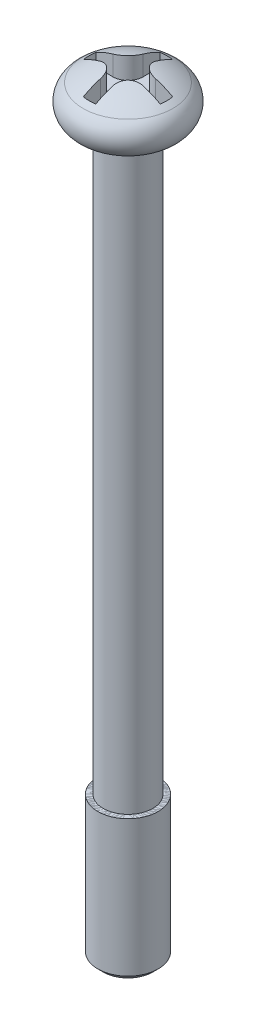
ISO-10303-21;
HEADER;
FILE_DESCRIPTION(('STEP AP214'),'2;1');
FILE_NAME('part.step','',(''),(''),'','','');
FILE_SCHEMA(('AUTOMOTIVE_DESIGN { 1 0 10303 214 1 1 1 1 }'));
ENDSEC;
DATA;
#1=APPLICATION_CONTEXT('core data for automotive mechanical design processes');
#2=APPLICATION_PROTOCOL_DEFINITION('international standard','automotive_design',2000,#1);
#3=PRODUCT_CONTEXT('',#1,'mechanical');
#4=PRODUCT('Part','Part','',(#3));
#5=PRODUCT_RELATED_PRODUCT_CATEGORY('part','',(#4));
#6=PRODUCT_DEFINITION_FORMATION('','',#4);
#7=PRODUCT_DEFINITION_CONTEXT('part definition',#1,'design');
#8=PRODUCT_DEFINITION('design','',#6,#7);
#9=PRODUCT_DEFINITION_SHAPE('','',#8);
#10=(LENGTH_UNIT() NAMED_UNIT(*) SI_UNIT(.MILLI.,.METRE.));
#11=(NAMED_UNIT(*) PLANE_ANGLE_UNIT() SI_UNIT($,.RADIAN.));
#12=(NAMED_UNIT(*) SI_UNIT($,.STERADIAN.) SOLID_ANGLE_UNIT());
#13=UNCERTAINTY_MEASURE_WITH_UNIT(LENGTH_MEASURE(1.E-05),#10,'distance_accuracy_value','');
#14=(GEOMETRIC_REPRESENTATION_CONTEXT(3) GLOBAL_UNCERTAINTY_ASSIGNED_CONTEXT((#13)) GLOBAL_UNIT_ASSIGNED_CONTEXT((#10,
#11,#12)) REPRESENTATION_CONTEXT('',''));
#15=CARTESIAN_POINT('',(0.,0.,0.));
#16=DIRECTION('',(0.,0.,1.));
#17=DIRECTION('',(1.,0.,0.));
#18=AXIS2_PLACEMENT_3D('',#15,#16,#17);
#19=CARTESIAN_POINT('',(0.,0.65,0.));
#20=DIRECTION('',(0.,-1.,0.));
#21=DIRECTION('',(0.,0.,-1.));
#22=AXIS2_PLACEMENT_3D('',#19,#20,#21);
#23=PLANE('',#22);
#24=DIRECTION('',(0.,0.,1.));
#25=VECTOR('',#24,1.);
#26=CARTESIAN_POINT('',(-0.1760407640086,0.65,1.085822107625));
#27=LINE('',#26,#25);
#28=CARTESIAN_POINT('',(-0.1760407640086,0.65,0.6010407640086));
#29=VERTEX_POINT('',#28);
#30=CARTESIAN_POINT('',(-0.1760407640086,0.65,1.08582210762502));
#31=VERTEX_POINT('',#30);
#32=EDGE_CURVE('P0_E159',#29,#31,#27,.T.);
#33=ORIENTED_EDGE('',*,*,#32,.T.);
#34=CARTESIAN_POINT('',(0.,0.65,0.));
#35=DIRECTION('',(0.,-1.,0.));
#36=DIRECTION('',(0.,0.,-1.));
#37=AXIS2_PLACEMENT_3D('',#34,#35,#36);
#38=CIRCLE('',#37,1.1);
#39=CARTESIAN_POINT('',(0.176040764008603,0.65,1.08582210762503));
#40=VERTEX_POINT('',#39);
#41=EDGE_CURVE('P0_E238',#31,#40,#38,.F.);
#42=ORIENTED_EDGE('',*,*,#41,.T.);
#43=DIRECTION('',(0.,0.,-1.));
#44=VECTOR('',#43,1.);
#45=CARTESIAN_POINT('',(0.1760407640086,0.65,0.6010407640086));
#46=LINE('',#45,#44);
#47=CARTESIAN_POINT('',(0.1760407640086,0.65,0.6010407640086));
#48=VERTEX_POINT('',#47);
#49=EDGE_CURVE('P0_E163',#40,#48,#46,.T.);
#50=ORIENTED_EDGE('',*,*,#49,.T.);
#51=CARTESIAN_POINT('',(0.6010407640086,0.65,0.6010407640086));
#52=DIRECTION('',(0.,-1.,0.));
#53=DIRECTION('',(0.,0.,-1.));
#54=AXIS2_PLACEMENT_3D('',#51,#52,#53);
#55=CIRCLE('',#54,0.425);
#56=CARTESIAN_POINT('',(0.6010407640086,0.65,0.1760407640086));
#57=VERTEX_POINT('',#56);
#58=EDGE_CURVE('P0_E166',#57,#48,#55,.F.);
#59=ORIENTED_EDGE('',*,*,#58,.F.);
#60=DIRECTION('',(1.,0.,0.));
#61=VECTOR('',#60,1.);
#62=CARTESIAN_POINT('',(1.085822107625,0.65,0.1760407640086));
#63=LINE('',#62,#61);
#64=CARTESIAN_POINT('',(1.08582210762502,0.65,0.1760407640086));
#65=VERTEX_POINT('',#64);
#66=EDGE_CURVE('P0_E167',#57,#65,#63,.T.);
#67=ORIENTED_EDGE('',*,*,#66,.T.);
#68=CARTESIAN_POINT('',(0.,0.65,0.));
#69=DIRECTION('',(0.,-1.,0.));
#70=DIRECTION('',(0.,0.,-1.));
#71=AXIS2_PLACEMENT_3D('',#68,#69,#70);
#72=CIRCLE('',#71,1.1);
#73=CARTESIAN_POINT('',(1.08582210762503,0.65,-0.176040764008603));
#74=VERTEX_POINT('',#73);
#75=EDGE_CURVE('P0_E249',#65,#74,#72,.F.);
#76=ORIENTED_EDGE('',*,*,#75,.T.);
#77=DIRECTION('',(-1.,0.,0.));
#78=VECTOR('',#77,1.);
#79=CARTESIAN_POINT('',(0.6010407640086,0.65,-0.1760407640086));
#80=LINE('',#79,#78);
#81=CARTESIAN_POINT('',(0.6010407640086,0.65,-0.1760407640086));
#82=VERTEX_POINT('',#81);
#83=EDGE_CURVE('P0_E171',#74,#82,#80,.T.);
#84=ORIENTED_EDGE('',*,*,#83,.T.);
#85=CARTESIAN_POINT('',(0.6010407640086,0.65,-0.6010407640086));
#86=DIRECTION('',(0.,-1.,0.));
#87=DIRECTION('',(0.,0.,-1.));
#88=AXIS2_PLACEMENT_3D('',#85,#86,#87);
#89=CIRCLE('',#88,0.425);
#90=CARTESIAN_POINT('',(0.1760407640086,0.65,-0.6010407640086));
#91=VERTEX_POINT('',#90);
#92=EDGE_CURVE('P0_E174',#91,#82,#89,.F.);
#93=ORIENTED_EDGE('',*,*,#92,.F.);
#94=DIRECTION('',(0.,0.,-1.));
#95=VECTOR('',#94,1.);
#96=CARTESIAN_POINT('',(0.1760407640086,0.65,-1.085822107625));
#97=LINE('',#96,#95);
#98=CARTESIAN_POINT('',(0.1760407640086,0.65,-1.08582210762502));
#99=VERTEX_POINT('',#98);
#100=EDGE_CURVE('P0_E176',#91,#99,#97,.T.);
#101=ORIENTED_EDGE('',*,*,#100,.T.);
#102=CARTESIAN_POINT('',(0.,0.65,0.));
#103=DIRECTION('',(0.,-1.,0.));
#104=DIRECTION('',(0.,0.,-1.));
#105=AXIS2_PLACEMENT_3D('',#102,#103,#104);
#106=CIRCLE('',#105,1.1);
#107=CARTESIAN_POINT('',(-0.176040764008603,0.65,-1.08582210762503));
#108=VERTEX_POINT('',#107);
#109=EDGE_CURVE('P0_E135',#99,#108,#106,.F.);
#110=ORIENTED_EDGE('',*,*,#109,.T.);
#111=DIRECTION('',(0.,0.,1.));
#112=VECTOR('',#111,1.);
#113=CARTESIAN_POINT('',(-0.1760407640086,0.65,-0.6010407640086));
#114=LINE('',#113,#112);
#115=CARTESIAN_POINT('',(-0.1760407640086,0.65,-0.6010407640086));
#116=VERTEX_POINT('',#115);
#117=EDGE_CURVE('P0_E131',#108,#116,#114,.T.);
#118=ORIENTED_EDGE('',*,*,#117,.T.);
#119=CARTESIAN_POINT('',(-0.6010407640086,0.65,-0.6010407640086));
#120=DIRECTION('',(0.,-1.,0.));
#121=DIRECTION('',(0.,0.,-1.));
#122=AXIS2_PLACEMENT_3D('',#119,#120,#121);
#123=CIRCLE('',#122,0.425);
#124=CARTESIAN_POINT('',(-0.6010407640086,0.65,-0.1760407640086));
#125=VERTEX_POINT('',#124);
#126=EDGE_CURVE('P0_E19',#125,#116,#123,.F.);
#127=ORIENTED_EDGE('',*,*,#126,.F.);
#128=DIRECTION('',(-1.,0.,0.));
#129=VECTOR('',#128,1.);
#130=CARTESIAN_POINT('',(-1.085822107625,0.65,-0.1760407640086));
#131=LINE('',#130,#129);
#132=CARTESIAN_POINT('',(-1.08582210762503,0.65,-0.176040764008602));
#133=VERTEX_POINT('',#132);
#134=EDGE_CURVE('P0_E126',#125,#133,#131,.T.);
#135=ORIENTED_EDGE('',*,*,#134,.T.);
#136=CARTESIAN_POINT('',(0.,0.65,0.));
#137=DIRECTION('',(0.,-1.,0.));
#138=DIRECTION('',(0.,0.,-1.));
#139=AXIS2_PLACEMENT_3D('',#136,#137,#138);
#140=CIRCLE('',#139,1.1);
#141=CARTESIAN_POINT('',(-1.08582210762502,0.65,0.1760407640086));
#142=VERTEX_POINT('',#141);
#143=EDGE_CURVE('P0_E246',#133,#142,#140,.F.);
#144=ORIENTED_EDGE('',*,*,#143,.T.);
#145=DIRECTION('',(1.,0.,0.));
#146=VECTOR('',#145,1.);
#147=CARTESIAN_POINT('',(-0.6010407640086,0.65,0.1760407640086));
#148=LINE('',#147,#146);
#149=CARTESIAN_POINT('',(-0.6010407640086,0.65,0.1760407640086));
#150=VERTEX_POINT('',#149);
#151=EDGE_CURVE('P0_E156',#142,#150,#148,.T.);
#152=ORIENTED_EDGE('',*,*,#151,.T.);
#153=CARTESIAN_POINT('',(-0.6010407640086,0.65,0.6010407640086));
#154=DIRECTION('',(0.,-1.,0.));
#155=DIRECTION('',(0.,0.,-1.));
#156=AXIS2_PLACEMENT_3D('',#153,#154,#155);
#157=CIRCLE('',#156,0.425);
#158=EDGE_CURVE('P0_E232',#29,#150,#157,.F.);
#159=ORIENTED_EDGE('',*,*,#158,.F.);
#160=EDGE_LOOP('',(#33,#42,#50,#59,#67,#76,#84,#93,#101,#110,#118,#127,#135,#144,#152,#159));
#161=FACE_BOUND('',#160,.T.);
#162=ADVANCED_FACE('P0_F16',(#161),#23,.F.);
#163=CARTESIAN_POINT('',(0.,-20.5,0.));
#164=DIRECTION('',(0.,-1.,0.));
#165=DIRECTION('',(0.,0.,-1.));
#166=AXIS2_PLACEMENT_3D('',#163,#164,#165);
#167=PLANE('',#166);
#168=CARTESIAN_POINT('',(0.,-20.49999999997,0.));
#169=DIRECTION('',(0.,1.,0.));
#170=DIRECTION('',(0.,0.,1.));
#171=AXIS2_PLACEMENT_3D('',#168,#169,#170);
#172=CIRCLE('',#171,0.699999999937972);
#173=CARTESIAN_POINT('',(0.,-20.49999999997,0.699999999937972));
#174=VERTEX_POINT('',#173);
#175=EDGE_CURVE('P0_E229',#174,#174,#172,.T.);
#176=ORIENTED_EDGE('',*,*,#175,.F.);
#177=EDGE_LOOP('',(#176));
#178=FACE_BOUND('',#177,.T.);
#179=ADVANCED_FACE('P0_F295',(#178),#167,.T.);
#180=CARTESIAN_POINT('',(-1.085822107625,0.65,-0.1760407640086));
#181=DIRECTION('',(0.,0.,-1.));
#182=DIRECTION('',(-1.,0.,0.));
#183=AXIS2_PLACEMENT_3D('',#180,#181,#182);
#184=PLANE('',#183);
#185=ORIENTED_EDGE('',*,*,#134,.F.);
#186=DIRECTION('',(0.,-1.,0.));
#187=VECTOR('',#186,1.);
#188=CARTESIAN_POINT('',(-0.6010407640086,0.65,-0.1760407640086));
#189=LINE('',#188,#187);
#190=CARTESIAN_POINT('',(-0.601040764008626,1.20897123010409,-0.1760407640086));
#191=VERTEX_POINT('',#190);
#192=EDGE_CURVE('P0_E145',#191,#125,#189,.T.);
#193=ORIENTED_EDGE('',*,*,#192,.F.);
#194=CARTESIAN_POINT('',(-1.08582210762492,1.00525588832583,-0.1760407640086));
#195=CARTESIAN_POINT('',(-1.00911068260352,1.04893062662544,-0.1760407640086));
#196=CARTESIAN_POINT('',(-0.930356524791466,1.08774427425678,-0.1760407640086));
#197=CARTESIAN_POINT('',(-0.768762743586045,1.1556493881829,-0.1760407640086));
#198=CARTESIAN_POINT('',(-0.685923120192677,1.18474085447768,-0.1760407640086));
#199=CARTESIAN_POINT('',(-0.601040764008653,1.20897123010419,-0.1760407640086));
#200=B_SPLINE_CURVE_WITH_KNOTS('',3,(#194,#195,#196,#197,#198,#199),.UNSPECIFIED.,.F.,.F.,(4,2,
4),(0.,0.263397892049687,0.526795784099374),.UNSPECIFIED.);
#201=CARTESIAN_POINT('',(-1.08582210762497,1.00525588832592,-0.176040764008602));
#202=VERTEX_POINT('',#201);
#203=EDGE_CURVE('P0_E281',#202,#191,#200,.T.);
#204=ORIENTED_EDGE('',*,*,#203,.F.);
#205=DIRECTION('',(0.,-1.,0.));
#206=VECTOR('',#205,1.);
#207=CARTESIAN_POINT('',(-1.08582210762503,0.65,-0.176040764008605));
#208=LINE('',#207,#206);
#209=EDGE_CURVE('P0_E244',#202,#133,#208,.T.);
#210=ORIENTED_EDGE('',*,*,#209,.T.);
#211=EDGE_LOOP('',(#185,#193,#204,#210));
#212=FACE_BOUND('',#211,.T.);
#213=ADVANCED_FACE('P0_F291',(#212),#184,.F.);
#214=CARTESIAN_POINT('',(-0.6010407640086,0.65,-0.6010407640086));
#215=DIRECTION('',(0.,-1.,0.));
#216=DIRECTION('',(0.,0.,-1.));
#217=AXIS2_PLACEMENT_3D('',#214,#215,#216);
#218=CYLINDRICAL_SURFACE('',#217,0.425);
#219=DIRECTION('',(0.,1.,0.));
#220=VECTOR('',#219,1.);
#221=CARTESIAN_POINT('',(-0.1760407640086,0.65,-0.6010407640086));
#222=LINE('',#221,#220);
#223=CARTESIAN_POINT('',(-0.1760407640086,1.2089712301041,-0.6010407640086));
#224=VERTEX_POINT('',#223);
#225=EDGE_CURVE('P0_E139',#116,#224,#222,.T.);
#226=ORIENTED_EDGE('',*,*,#225,.T.);
#227=CARTESIAN_POINT('',(-0.601040764008653,1.20897123010419,-0.1760407640086));
#228=CARTESIAN_POINT('',(-0.578406656289432,1.21542783340371,-0.176018874184441));
#229=CARTESIAN_POINT('',(-0.555608255013388,1.22137419741672,-0.177848604462526));
#230=CARTESIAN_POINT('',(-0.510306770705131,1.23209653283575,-0.185210473316388));
#231=CARTESIAN_POINT('',(-0.487804112664417,1.23687096416289,-0.190747448493527));
#232=CARTESIAN_POINT('',(-0.443735497302781,1.2450902318632,-0.205538152041344));
#233=CARTESIAN_POINT('',(-0.422171554483217,1.24853232289887,-0.214799475400786));
#234=CARTESIAN_POINT('',(-0.380743177315682,1.25394966792063,-0.236838270399476));
#235=CARTESIAN_POINT('',(-0.360877104530317,1.25592635048849,-0.249612300904842));
#236=CARTESIAN_POINT('',(-0.324191480826727,1.25829821343897,-0.277785301149672));
#237=CARTESIAN_POINT('',(-0.307284927519612,1.25875056319384,-0.293066261805763));
#238=CARTESIAN_POINT('',(-0.276142113695838,1.25821839578424,-0.326120227648609));
#239=CARTESIAN_POINT('',(-0.2619056775364,1.25723397316942,-0.34389306878266));
#240=CARTESIAN_POINT('',(-0.236751207161094,1.25389684876541,-0.38101557472462));
#241=CARTESIAN_POINT('',(-0.225773302430262,1.25157149586508,-0.40032725963673));
#242=CARTESIAN_POINT('',(-0.207004305330157,1.24564867417569,-0.440269167055185));
#243=CARTESIAN_POINT('',(-0.199214723490962,1.24205060391335,-0.46090000919869));
#244=CARTESIAN_POINT('',(-0.187378692373079,1.233983974644,-0.501428548839066));
#245=CARTESIAN_POINT('',(-0.183109941953516,1.22959318040616,-0.521277724851874));
#246=CARTESIAN_POINT('',(-0.177437095517381,1.21992210133309,-0.561138876060438));
#247=CARTESIAN_POINT('',(-0.17602890574499,1.21464309935483,-0.581150577399594));
#248=CARTESIAN_POINT('',(-0.1760407640086,1.20897123010419,-0.601040764008652));
#249=B_SPLINE_CURVE_WITH_KNOTS('',3,(#227,#228,#229,#230,#231,#232,#233,#234,#235,#236,#237,
#238,#239,#240,#241,#242,#243,#244,#245,#246,#247,#248),.UNSPECIFIED.,.F.,.F.,(4,2,2,2,2,2,2,2,
2,2,4),(0.,0.0705610028627824,0.141214241920231,0.212012299343925,0.282741246824953,
0.350786120304269,0.418826516157694,0.485525948293452,0.552256944109077,0.614355676372316,
0.676365476190422),.UNSPECIFIED.);
#250=EDGE_CURVE('P0_E271',#191,#224,#249,.T.);
#251=ORIENTED_EDGE('',*,*,#250,.F.);
#252=ORIENTED_EDGE('',*,*,#192,.T.);
#253=ORIENTED_EDGE('',*,*,#126,.T.);
#254=EDGE_LOOP('',(#226,#251,#252,#253));
#255=FACE_BOUND('',#254,.T.);
#256=ADVANCED_FACE('P0_F142',(#255),#218,.T.);
#257=CARTESIAN_POINT('',(-0.1760407640086,0.65,-0.6010407640086));
#258=DIRECTION('',(-1.,0.,0.));
#259=DIRECTION('',(0.,0.,1.));
#260=AXIS2_PLACEMENT_3D('',#257,#258,#259);
#261=PLANE('',#260);
#262=ORIENTED_EDGE('',*,*,#117,.F.);
#263=DIRECTION('',(0.,-1.,0.));
#264=VECTOR('',#263,1.);
#265=CARTESIAN_POINT('',(-0.176040764008605,0.65,-1.08582210762503));
#266=LINE('',#265,#264);
#267=CARTESIAN_POINT('',(-0.1760407640086,1.00525588832588,-1.08582210762493));
#268=VERTEX_POINT('',#267);
#269=EDGE_CURVE('P0_E151',#108,#268,#266,.F.);
#270=ORIENTED_EDGE('',*,*,#269,.T.);
#271=CARTESIAN_POINT('',(-0.1760407640086,-0.9,0.));
#272=DIRECTION('',(-1.,0.,0.));
#273=DIRECTION('',(0.,0.,1.));
#274=AXIS2_PLACEMENT_3D('',#271,#272,#273);
#275=CIRCLE('',#274,2.19294542782242);
#276=EDGE_CURVE('P0_E148',#224,#268,#275,.T.);
#277=ORIENTED_EDGE('',*,*,#276,.F.);
#278=ORIENTED_EDGE('',*,*,#225,.F.);
#279=EDGE_LOOP('',(#262,#270,#277,#278));
#280=FACE_BOUND('',#279,.T.);
#281=ADVANCED_FACE('P0_F146',(#280),#261,.F.);
#282=CARTESIAN_POINT('',(0.,0.65,0.));
#283=DIRECTION('',(0.,-1.,0.));
#284=DIRECTION('',(0.,0.,-1.));
#285=AXIS2_PLACEMENT_3D('',#282,#283,#284);
#286=CYLINDRICAL_SURFACE('',#285,1.1);
#287=ORIENTED_EDGE('',*,*,#109,.F.);
#288=DIRECTION('',(0.,1.,0.));
#289=VECTOR('',#288,1.);
#290=CARTESIAN_POINT('',(0.1760407640086,0.65,-1.085822107625));
#291=LINE('',#290,#289);
#292=CARTESIAN_POINT('',(0.1760407640086,1.00525588832589,-1.08582210762491));
#293=VERTEX_POINT('',#292);
#294=EDGE_CURVE('P0_E177',#99,#293,#291,.T.);
#295=ORIENTED_EDGE('',*,*,#294,.T.);
#296=CARTESIAN_POINT('',(0.,1.005255888326,0.));
#297=DIRECTION('',(0.,-1.,0.));
#298=DIRECTION('',(0.,0.,-1.));
#299=AXIS2_PLACEMENT_3D('',#296,#297,#298);
#300=CIRCLE('',#299,1.1);
#301=EDGE_CURVE('P0_E259',#268,#293,#300,.T.);
#302=ORIENTED_EDGE('',*,*,#301,.F.);
#303=ORIENTED_EDGE('',*,*,#269,.F.);
#304=EDGE_LOOP('',(#287,#295,#302,#303));
#305=FACE_BOUND('',#304,.T.);
#306=ADVANCED_FACE('P0_F257',(#305),#286,.F.);
#307=CARTESIAN_POINT('',(0.1760407640086,0.65,-1.085822107625));
#308=DIRECTION('',(1.,0.,0.));
#309=DIRECTION('',(0.,0.,-1.));
#310=AXIS2_PLACEMENT_3D('',#307,#308,#309);
#311=PLANE('',#310);
#312=ORIENTED_EDGE('',*,*,#100,.F.);
#313=DIRECTION('',(0.,-1.,0.));
#314=VECTOR('',#313,1.);
#315=CARTESIAN_POINT('',(0.1760407640086,0.65,-0.6010407640086));
#316=LINE('',#315,#314);
#317=CARTESIAN_POINT('',(0.1760407640086,1.2089712301041,-0.6010407640086));
#318=VERTEX_POINT('',#317);
#319=EDGE_CURVE('P0_E251',#318,#91,#316,.T.);
#320=ORIENTED_EDGE('',*,*,#319,.F.);
#321=CARTESIAN_POINT('',(0.1760407640086,-0.9,0.));
#322=DIRECTION('',(-1.,0.,0.));
#323=DIRECTION('',(0.,0.,1.));
#324=AXIS2_PLACEMENT_3D('',#321,#322,#323);
#325=CIRCLE('',#324,2.19294542782242);
#326=EDGE_CURVE('P0_E262',#293,#318,#325,.F.);
#327=ORIENTED_EDGE('',*,*,#326,.F.);
#328=ORIENTED_EDGE('',*,*,#294,.F.);
#329=EDGE_LOOP('',(#312,#320,#327,#328));
#330=FACE_BOUND('',#329,.T.);
#331=ADVANCED_FACE('P0_F263',(#330),#311,.F.);
#332=CARTESIAN_POINT('',(0.6010407640086,0.65,-0.6010407640086));
#333=DIRECTION('',(0.,-1.,0.));
#334=DIRECTION('',(0.,0.,-1.));
#335=AXIS2_PLACEMENT_3D('',#332,#333,#334);
#336=CYLINDRICAL_SURFACE('',#335,0.425);
#337=DIRECTION('',(0.,1.,0.));
#338=VECTOR('',#337,1.);
#339=CARTESIAN_POINT('',(0.6010407640086,0.65,-0.1760407640086));
#340=LINE('',#339,#338);
#341=CARTESIAN_POINT('',(0.601040764008626,1.20897123010409,-0.1760407640086));
#342=VERTEX_POINT('',#341);
#343=EDGE_CURVE('P0_E173',#82,#342,#340,.T.);
#344=ORIENTED_EDGE('',*,*,#343,.T.);
#345=CARTESIAN_POINT('',(0.1760407640086,1.20897123010419,-0.601040764008652));
#346=CARTESIAN_POINT('',(0.176018874184441,1.21542783340371,-0.578406656289441));
#347=CARTESIAN_POINT('',(0.177848604462525,1.22137419741671,-0.555608255013406));
#348=CARTESIAN_POINT('',(0.185210473316381,1.23209653283574,-0.510306770705169));
#349=CARTESIAN_POINT('',(0.190747448493515,1.23687096416288,-0.487804112664464));
#350=CARTESIAN_POINT('',(0.205538152041319,1.24509023186319,-0.443735497302846));
#351=CARTESIAN_POINT('',(0.214799475400753,1.24853232289886,-0.42217155448329));
#352=CARTESIAN_POINT('',(0.236838270399424,1.25394966792062,-0.380743177315768));
#353=CARTESIAN_POINT('',(0.24961230090478,1.25592635048848,-0.36087710453041));
#354=CARTESIAN_POINT('',(0.277785301149594,1.25829821343896,-0.32419148082682));
#355=CARTESIAN_POINT('',(0.293066261805679,1.25875056319384,-0.3072849275197));
#356=CARTESIAN_POINT('',(0.326120227648518,1.25821839578425,-0.276142113695916));
#357=CARTESIAN_POINT('',(0.343893068782565,1.25723397316943,-0.261905677536472));
#358=CARTESIAN_POINT('',(0.381015574724519,1.25389684876542,-0.236751207161156));
#359=CARTESIAN_POINT('',(0.400327259636626,1.25157149586509,-0.225773302430318));
#360=CARTESIAN_POINT('',(0.440269167055076,1.2456486741757,-0.207004305330201));
#361=CARTESIAN_POINT('',(0.46090000919858,1.24205060391337,-0.199214723490999));
#362=CARTESIAN_POINT('',(0.501428548838972,1.23398397464402,-0.1873786923731));
#363=CARTESIAN_POINT('',(0.521277724851799,1.22959318040618,-0.183109941953529));
#364=CARTESIAN_POINT('',(0.561138876060401,1.2199221013331,-0.177437095517384));
#365=CARTESIAN_POINT('',(0.581150577399576,1.21464309935484,-0.17602890574499));
#366=CARTESIAN_POINT('',(0.601040764008653,1.20897123010419,-0.1760407640086));
#367=B_SPLINE_CURVE_WITH_KNOTS('',3,(#345,#346,#347,#348,#349,#350,#351,#352,#353,#354,#355,
#356,#357,#358,#359,#360,#361,#362,#363,#364,#365,#366),.UNSPECIFIED.,.F.,.F.,(4,2,2,2,2,2,2,2,
2,2,4),(0.,0.0705610028627521,0.14121424192017,0.212012299343833,0.28274124682483,
0.350786120304148,0.418826516157574,0.485525948293332,0.552256944108958,0.614355676372256,
0.676365476190422),.UNSPECIFIED.);
#368=EDGE_CURVE('P0_E267',#318,#342,#367,.T.);
#369=ORIENTED_EDGE('',*,*,#368,.F.);
#370=ORIENTED_EDGE('',*,*,#319,.T.);
#371=ORIENTED_EDGE('',*,*,#92,.T.);
#372=EDGE_LOOP('',(#344,#369,#370,#371));
#373=FACE_BOUND('',#372,.T.);
#374=ADVANCED_FACE('P0_F351',(#373),#336,.T.);
#375=CARTESIAN_POINT('',(0.6010407640086,0.65,-0.1760407640086));
#376=DIRECTION('',(0.,0.,-1.));
#377=DIRECTION('',(-1.,0.,0.));
#378=AXIS2_PLACEMENT_3D('',#375,#376,#377);
#379=PLANE('',#378);
#380=ORIENTED_EDGE('',*,*,#83,.F.);
#381=DIRECTION('',(0.,-1.,0.));
#382=VECTOR('',#381,1.);
#383=CARTESIAN_POINT('',(1.08582210762503,0.65,-0.176040764008605));
#384=LINE('',#383,#382);
#385=CARTESIAN_POINT('',(1.08582210762503,1.005255888326,-0.176040764008603));
#386=VERTEX_POINT('',#385);
#387=EDGE_CURVE('P0_E170',#74,#386,#384,.F.);
#388=ORIENTED_EDGE('',*,*,#387,.T.);
#389=CARTESIAN_POINT('',(0.601040764008653,1.20897123010419,-0.1760407640086));
#390=CARTESIAN_POINT('',(0.685923120192677,1.18474085447768,-0.1760407640086));
#391=CARTESIAN_POINT('',(0.768762743586045,1.1556493881829,-0.1760407640086));
#392=CARTESIAN_POINT('',(0.930356524791466,1.08774427425678,-0.1760407640086));
#393=CARTESIAN_POINT('',(1.00911068260352,1.04893062662544,-0.1760407640086));
#394=CARTESIAN_POINT('',(1.08582210762492,1.00525588832583,-0.1760407640086));
#395=B_SPLINE_CURVE_WITH_KNOTS('',3,(#389,#390,#391,#392,#393,#394),.UNSPECIFIED.,.F.,.F.,(4,2,
4),(0.,0.263397892049687,0.526795784099374),.UNSPECIFIED.);
#396=EDGE_CURVE('P0_E358',#342,#386,#395,.T.);
#397=ORIENTED_EDGE('',*,*,#396,.F.);
#398=ORIENTED_EDGE('',*,*,#343,.F.);
#399=EDGE_LOOP('',(#380,#388,#397,#398));
#400=FACE_BOUND('',#399,.T.);
#401=ADVANCED_FACE('P0_F355',(#400),#379,.F.);
#402=CARTESIAN_POINT('',(0.,0.65,0.));
#403=DIRECTION('',(0.,-1.,0.));
#404=DIRECTION('',(0.,0.,-1.));
#405=AXIS2_PLACEMENT_3D('',#402,#403,#404);
#406=CYLINDRICAL_SURFACE('',#405,1.1);
#407=ORIENTED_EDGE('',*,*,#143,.F.);
#408=ORIENTED_EDGE('',*,*,#209,.F.);
#409=CARTESIAN_POINT('',(0.,1.005255888326,0.));
#410=DIRECTION('',(0.,-1.,0.));
#411=DIRECTION('',(0.,0.,-1.));
#412=AXIS2_PLACEMENT_3D('',#409,#410,#411);
#413=CIRCLE('',#412,1.1);
#414=CARTESIAN_POINT('',(-1.08582210762502,1.005255888326,0.1760407640086));
#415=VERTEX_POINT('',#414);
#416=EDGE_CURVE('P0_E360',#415,#202,#413,.T.);
#417=ORIENTED_EDGE('',*,*,#416,.F.);
#418=DIRECTION('',(0.,1.,0.));
#419=VECTOR('',#418,1.);
#420=CARTESIAN_POINT('',(-1.085822107625,0.65,0.1760407640086));
#421=LINE('',#420,#419);
#422=EDGE_CURVE('P0_E158',#415,#142,#421,.F.);
#423=ORIENTED_EDGE('',*,*,#422,.T.);
#424=EDGE_LOOP('',(#407,#408,#417,#423));
#425=FACE_BOUND('',#424,.T.);
#426=ADVANCED_FACE('P0_F438',(#425),#406,.F.);
#427=CARTESIAN_POINT('',(0.,0.65,0.));
#428=DIRECTION('',(0.,-1.,0.));
#429=DIRECTION('',(0.,0.,-1.));
#430=AXIS2_PLACEMENT_3D('',#427,#428,#429);
#431=CYLINDRICAL_SURFACE('',#430,1.1);
#432=ORIENTED_EDGE('',*,*,#387,.F.);
#433=ORIENTED_EDGE('',*,*,#75,.F.);
#434=DIRECTION('',(0.,1.,0.));
#435=VECTOR('',#434,1.);
#436=CARTESIAN_POINT('',(1.085822107625,0.65,0.1760407640086));
#437=LINE('',#436,#435);
#438=CARTESIAN_POINT('',(1.08582210762496,1.00525588832592,0.176040764008601));
#439=VERTEX_POINT('',#438);
#440=EDGE_CURVE('P0_E169',#65,#439,#437,.T.);
#441=ORIENTED_EDGE('',*,*,#440,.T.);
#442=CARTESIAN_POINT('',(0.,1.005255888326,0.));
#443=DIRECTION('',(0.,-1.,0.));
#444=DIRECTION('',(0.,0.,-1.));
#445=AXIS2_PLACEMENT_3D('',#442,#443,#444);
#446=CIRCLE('',#445,1.1);
#447=EDGE_CURVE('P0_E589',#386,#439,#446,.T.);
#448=ORIENTED_EDGE('',*,*,#447,.F.);
#449=EDGE_LOOP('',(#432,#433,#441,#448));
#450=FACE_BOUND('',#449,.T.);
#451=ADVANCED_FACE('P0_F445',(#450),#431,.F.);
#452=CARTESIAN_POINT('',(1.085822107625,0.65,0.1760407640086));
#453=DIRECTION('',(0.,0.,1.));
#454=DIRECTION('',(1.,0.,0.));
#455=AXIS2_PLACEMENT_3D('',#452,#453,#454);
#456=PLANE('',#455);
#457=ORIENTED_EDGE('',*,*,#66,.F.);
#458=DIRECTION('',(0.,-1.,0.));
#459=VECTOR('',#458,1.);
#460=CARTESIAN_POINT('',(0.6010407640086,0.65,0.1760407640086));
#461=LINE('',#460,#459);
#462=CARTESIAN_POINT('',(0.601040764008626,1.20897123010409,0.1760407640086));
#463=VERTEX_POINT('',#462);
#464=EDGE_CURVE('P0_E240',#463,#57,#461,.T.);
#465=ORIENTED_EDGE('',*,*,#464,.F.);
#466=CARTESIAN_POINT('',(1.08582210762491,1.00525588832583,0.176040764008601));
#467=CARTESIAN_POINT('',(1.00911068260352,1.04893062662545,0.176040764008601));
#468=CARTESIAN_POINT('',(0.930356524791462,1.08774427425678,0.1760407640086));
#469=CARTESIAN_POINT('',(0.768762743586043,1.1556493881829,0.1760407640086));
#470=CARTESIAN_POINT('',(0.685923120192676,1.18474085447768,0.1760407640086));
#471=CARTESIAN_POINT('',(0.601040764008653,1.20897123010419,0.176040764008601));
#472=B_SPLINE_CURVE_WITH_KNOTS('',3,(#466,#467,#468,#469,#470,#471),.UNSPECIFIED.,.F.,.F.,(4,2,
4),(0.,0.263397892049684,0.526795784099368),.UNSPECIFIED.);
#473=EDGE_CURVE('P0_E587',#439,#463,#472,.T.);
#474=ORIENTED_EDGE('',*,*,#473,.F.);
#475=ORIENTED_EDGE('',*,*,#440,.F.);
#476=EDGE_LOOP('',(#457,#465,#474,#475));
#477=FACE_BOUND('',#476,.T.);
#478=ADVANCED_FACE('P0_F453',(#477),#456,.F.);
#479=CARTESIAN_POINT('',(0.6010407640086,0.65,0.6010407640086));
#480=DIRECTION('',(0.,-1.,0.));
#481=DIRECTION('',(0.,0.,-1.));
#482=AXIS2_PLACEMENT_3D('',#479,#480,#481);
#483=CYLINDRICAL_SURFACE('',#482,0.425);
#484=DIRECTION('',(0.,1.,0.));
#485=VECTOR('',#484,1.);
#486=CARTESIAN_POINT('',(0.1760407640086,0.65,0.6010407640086));
#487=LINE('',#486,#485);
#488=CARTESIAN_POINT('',(0.1760407640086,1.2089712301041,0.6010407640086));
#489=VERTEX_POINT('',#488);
#490=EDGE_CURVE('P0_E165',#48,#489,#487,.T.);
#491=ORIENTED_EDGE('',*,*,#490,.T.);
#492=CARTESIAN_POINT('',(0.601040764008653,1.20897123010419,0.176040764008601));
#493=CARTESIAN_POINT('',(0.578406656289432,1.21542783340371,0.176018874184441));
#494=CARTESIAN_POINT('',(0.555608255013388,1.22137419741672,0.177848604462526));
#495=CARTESIAN_POINT('',(0.510306770705131,1.23209653283575,0.185210473316388));
#496=CARTESIAN_POINT('',(0.487804112664417,1.23687096416289,0.190747448493528));
#497=CARTESIAN_POINT('',(0.443735497302781,1.2450902318632,0.205538152041345));
#498=CARTESIAN_POINT('',(0.422171554483217,1.24853232289887,0.214799475400787));
#499=CARTESIAN_POINT('',(0.380743177315681,1.25394966792063,0.236838270399477));
#500=CARTESIAN_POINT('',(0.360877104530316,1.25592635048849,0.249612300904843));
#501=CARTESIAN_POINT('',(0.324191480826726,1.25829821343897,0.277785301149674));
#502=CARTESIAN_POINT('',(0.307284927519611,1.25875056319384,0.293066261805763));
#503=CARTESIAN_POINT('',(0.276142113695838,1.25821839578424,0.32612022764861));
#504=CARTESIAN_POINT('',(0.261905677536399,1.25723397316942,0.343893068782661));
#505=CARTESIAN_POINT('',(0.236751207161094,1.25389684876541,0.381015574724621));
#506=CARTESIAN_POINT('',(0.225773302430261,1.25157149586508,0.40032725963673));
#507=CARTESIAN_POINT('',(0.207004305330157,1.24564867417569,0.440269167055185));
#508=CARTESIAN_POINT('',(0.199214723490961,1.24205060391335,0.460900009198691));
#509=CARTESIAN_POINT('',(0.187378692373079,1.233983974644,0.501428548839067));
#510=CARTESIAN_POINT('',(0.183109941953516,1.22959318040616,0.521277724851875));
#511=CARTESIAN_POINT('',(0.177437095517381,1.21992210133309,0.56113887606044));
#512=CARTESIAN_POINT('',(0.17602890574499,1.21464309935483,0.581150577399596));
#513=CARTESIAN_POINT('',(0.1760407640086,1.20897123010419,0.601040764008654));
#514=B_SPLINE_CURVE_WITH_KNOTS('',3,(#492,#493,#494,#495,#496,#497,#498,#499,#500,#501,#502,
#503,#504,#505,#506,#507,#508,#509,#510,#511,#512,#513),.UNSPECIFIED.,.F.,.F.,(4,2,2,2,2,2,2,2,
2,2,4),(0.,0.0705610028627828,0.141214241920231,0.212012299343926,0.282741246824955,
0.350786120304271,0.418826516157695,0.485525948293453,0.552256944109077,0.614355676372318,
0.676365476190425),.UNSPECIFIED.);
#515=EDGE_CURVE('P0_E583',#463,#489,#514,.T.);
#516=ORIENTED_EDGE('',*,*,#515,.F.);
#517=ORIENTED_EDGE('',*,*,#464,.T.);
#518=ORIENTED_EDGE('',*,*,#58,.T.);
#519=EDGE_LOOP('',(#491,#516,#517,#518));
#520=FACE_BOUND('',#519,.T.);
#521=ADVANCED_FACE('P0_F462',(#520),#483,.T.);
#522=CARTESIAN_POINT('',(0.1760407640086,0.65,0.6010407640086));
#523=DIRECTION('',(1.,0.,0.));
#524=DIRECTION('',(0.,0.,-1.));
#525=AXIS2_PLACEMENT_3D('',#522,#523,#524);
#526=PLANE('',#525);
#527=ORIENTED_EDGE('',*,*,#49,.F.);
#528=DIRECTION('',(0.,-1.,0.));
#529=VECTOR('',#528,1.);
#530=CARTESIAN_POINT('',(0.176040764008605,0.65,1.08582210762503));
#531=LINE('',#530,#529);
#532=CARTESIAN_POINT('',(0.1760407640086,1.00525588832588,1.08582210762493));
#533=VERTEX_POINT('',#532);
#534=EDGE_CURVE('P0_E162',#40,#533,#531,.F.);
#535=ORIENTED_EDGE('',*,*,#534,.T.);
#536=CARTESIAN_POINT('',(0.1760407640086,-0.9,0.));
#537=DIRECTION('',(-1.,0.,0.));
#538=DIRECTION('',(0.,0.,1.));
#539=AXIS2_PLACEMENT_3D('',#536,#537,#538);
#540=CIRCLE('',#539,2.19294542782242);
#541=EDGE_CURVE('P0_E579',#489,#533,#540,.F.);
#542=ORIENTED_EDGE('',*,*,#541,.F.);
#543=ORIENTED_EDGE('',*,*,#490,.F.);
#544=EDGE_LOOP('',(#527,#535,#542,#543));
#545=FACE_BOUND('',#544,.T.);
#546=ADVANCED_FACE('P0_F471',(#545),#526,.F.);
#547=CARTESIAN_POINT('',(0.,0.65,0.));
#548=DIRECTION('',(0.,-1.,0.));
#549=DIRECTION('',(0.,0.,-1.));
#550=AXIS2_PLACEMENT_3D('',#547,#548,#549);
#551=CYLINDRICAL_SURFACE('',#550,1.1);
#552=ORIENTED_EDGE('',*,*,#41,.F.);
#553=DIRECTION('',(0.,1.,0.));
#554=VECTOR('',#553,1.);
#555=CARTESIAN_POINT('',(-0.1760407640086,0.65,1.085822107625));
#556=LINE('',#555,#554);
#557=CARTESIAN_POINT('',(-0.1760407640086,1.00525588832589,1.08582210762491));
#558=VERTEX_POINT('',#557);
#559=EDGE_CURVE('P0_E161',#31,#558,#556,.T.);
#560=ORIENTED_EDGE('',*,*,#559,.T.);
#561=CARTESIAN_POINT('',(0.,1.005255888326,0.));
#562=DIRECTION('',(0.,-1.,0.));
#563=DIRECTION('',(0.,0.,-1.));
#564=AXIS2_PLACEMENT_3D('',#561,#562,#563);
#565=CIRCLE('',#564,1.1);
#566=EDGE_CURVE('P0_E575',#533,#558,#565,.T.);
#567=ORIENTED_EDGE('',*,*,#566,.F.);
#568=ORIENTED_EDGE('',*,*,#534,.F.);
#569=EDGE_LOOP('',(#552,#560,#567,#568));
#570=FACE_BOUND('',#569,.T.);
#571=ADVANCED_FACE('P0_F480',(#570),#551,.F.);
#572=CARTESIAN_POINT('',(-0.1760407640086,0.65,1.085822107625));
#573=DIRECTION('',(-1.,0.,0.));
#574=DIRECTION('',(0.,0.,1.));
#575=AXIS2_PLACEMENT_3D('',#572,#573,#574);
#576=PLANE('',#575);
#577=ORIENTED_EDGE('',*,*,#32,.F.);
#578=DIRECTION('',(0.,-1.,0.));
#579=VECTOR('',#578,1.);
#580=CARTESIAN_POINT('',(-0.1760407640086,0.65,0.6010407640086));
#581=LINE('',#580,#579);
#582=CARTESIAN_POINT('',(-0.1760407640086,1.2089712301041,0.6010407640086));
#583=VERTEX_POINT('',#582);
#584=EDGE_CURVE('P0_E233',#583,#29,#581,.T.);
#585=ORIENTED_EDGE('',*,*,#584,.F.);
#586=CARTESIAN_POINT('',(-0.1760407640086,-0.9,0.));
#587=DIRECTION('',(-1.,0.,0.));
#588=DIRECTION('',(0.,0.,1.));
#589=AXIS2_PLACEMENT_3D('',#586,#587,#588);
#590=CIRCLE('',#589,2.19294542782242);
#591=EDGE_CURVE('P0_E569',#558,#583,#590,.T.);
#592=ORIENTED_EDGE('',*,*,#591,.F.);
#593=ORIENTED_EDGE('',*,*,#559,.F.);
#594=EDGE_LOOP('',(#577,#585,#592,#593));
#595=FACE_BOUND('',#594,.T.);
#596=ADVANCED_FACE('P0_F489',(#595),#576,.F.);
#597=CARTESIAN_POINT('',(-0.6010407640086,0.65,0.6010407640086));
#598=DIRECTION('',(0.,-1.,0.));
#599=DIRECTION('',(0.,0.,-1.));
#600=AXIS2_PLACEMENT_3D('',#597,#598,#599);
#601=CYLINDRICAL_SURFACE('',#600,0.425);
#602=DIRECTION('',(0.,1.,0.));
#603=VECTOR('',#602,1.);
#604=CARTESIAN_POINT('',(-0.6010407640086,0.65,0.1760407640086));
#605=LINE('',#604,#603);
#606=CARTESIAN_POINT('',(-0.601040764008626,1.20897123010409,0.1760407640086));
#607=VERTEX_POINT('',#606);
#608=EDGE_CURVE('P0_E34',#150,#607,#605,.T.);
#609=ORIENTED_EDGE('',*,*,#608,.T.);
#610=CARTESIAN_POINT('',(-0.1760407640086,1.20897123010419,0.601040764008652));
#611=CARTESIAN_POINT('',(-0.176018874184441,1.21542783340371,0.578406656289441));
#612=CARTESIAN_POINT('',(-0.177848604462525,1.22137419741671,0.555608255013407));
#613=CARTESIAN_POINT('',(-0.18521047331638,1.23209653283574,0.51030677070517));
#614=CARTESIAN_POINT('',(-0.190747448493515,1.23687096416288,0.487804112664465));
#615=CARTESIAN_POINT('',(-0.205538152041319,1.24509023186319,0.443735497302847));
#616=CARTESIAN_POINT('',(-0.214799475400753,1.24853232289886,0.422171554483291));
#617=CARTESIAN_POINT('',(-0.236838270399424,1.25394966792062,0.380743177315769));
#618=CARTESIAN_POINT('',(-0.24961230090478,1.25592635048848,0.36087710453041));
#619=CARTESIAN_POINT('',(-0.277785301149593,1.25829821343896,0.32419148082682));
#620=CARTESIAN_POINT('',(-0.293066261805678,1.25875056319384,0.3072849275197));
#621=CARTESIAN_POINT('',(-0.326120227648517,1.25821839578425,0.276142113695917));
#622=CARTESIAN_POINT('',(-0.343893068782565,1.25723397316943,0.261905677536473));
#623=CARTESIAN_POINT('',(-0.381015574724519,1.25389684876542,0.236751207161157));
#624=CARTESIAN_POINT('',(-0.400327259636625,1.25157149586509,0.225773302430318));
#625=CARTESIAN_POINT('',(-0.440269167055075,1.24564867417571,0.207004305330202));
#626=CARTESIAN_POINT('',(-0.460900009198579,1.24205060391337,0.199214723491));
#627=CARTESIAN_POINT('',(-0.501428548838972,1.23398397464402,0.187378692373101));
#628=CARTESIAN_POINT('',(-0.521277724851798,1.22959318040618,0.18310994195353));
#629=CARTESIAN_POINT('',(-0.561138876060401,1.2199221013331,0.177437095517384));
#630=CARTESIAN_POINT('',(-0.581150577399576,1.21464309935484,0.176028905744989));
#631=CARTESIAN_POINT('',(-0.601040764008653,1.20897123010419,0.176040764008599));
#632=B_SPLINE_CURVE_WITH_KNOTS('',3,(#610,#611,#612,#613,#614,#615,#616,#617,#618,#619,#620,
#621,#622,#623,#624,#625,#626,#627,#628,#629,#630,#631),.UNSPECIFIED.,.F.,.F.,(4,2,2,2,2,2,2,2,
2,2,4),(0.,0.0705610028627522,0.14121424192017,0.212012299343833,0.282741246824831,
0.350786120304148,0.418826516157574,0.485525948293332,0.552256944108958,0.614355676372257,
0.676365476190423),.UNSPECIFIED.);
#633=EDGE_CURVE('P0_E200',#583,#607,#632,.T.);
#634=ORIENTED_EDGE('',*,*,#633,.F.);
#635=ORIENTED_EDGE('',*,*,#584,.T.);
#636=ORIENTED_EDGE('',*,*,#158,.T.);
#637=EDGE_LOOP('',(#609,#634,#635,#636));
#638=FACE_BOUND('',#637,.T.);
#639=ADVANCED_FACE('P0_F498',(#638),#601,.T.);
#640=CARTESIAN_POINT('',(-0.6010407640086,0.65,0.1760407640086));
#641=DIRECTION('',(0.,0.,1.));
#642=DIRECTION('',(1.,0.,0.));
#643=AXIS2_PLACEMENT_3D('',#640,#641,#642);
#644=PLANE('',#643);
#645=ORIENTED_EDGE('',*,*,#151,.F.);
#646=ORIENTED_EDGE('',*,*,#422,.F.);
#647=CARTESIAN_POINT('',(-0.601040764008653,1.20897123010419,0.176040764008601));
#648=CARTESIAN_POINT('',(-0.685923120192676,1.18474085447768,0.176040764008601));
#649=CARTESIAN_POINT('',(-0.768762743586043,1.1556493881829,0.1760407640086));
#650=CARTESIAN_POINT('',(-0.930356524791462,1.08774427425678,0.1760407640086));
#651=CARTESIAN_POINT('',(-1.00911068260352,1.04893062662545,0.176040764008599));
#652=CARTESIAN_POINT('',(-1.08582210762491,1.00525588832583,0.176040764008598));
#653=B_SPLINE_CURVE_WITH_KNOTS('',3,(#647,#648,#649,#650,#651,#652),.UNSPECIFIED.,.F.,.F.,(4,2,
4),(0.,0.263397892049684,0.526795784099368),.UNSPECIFIED.);
#654=EDGE_CURVE('P0_E191',#607,#415,#653,.T.);
#655=ORIENTED_EDGE('',*,*,#654,.F.);
#656=ORIENTED_EDGE('',*,*,#608,.F.);
#657=EDGE_LOOP('',(#645,#646,#655,#656));
#658=FACE_BOUND('',#657,.T.);
#659=ADVANCED_FACE('P0_F207',(#658),#644,.F.);
#660=CARTESIAN_POINT('',(0.,-20.3500000000645,0.));
#661=DIRECTION('',(0.,1.,0.));
#662=DIRECTION('',(0.,0.,1.));
#663=AXIS2_PLACEMENT_3D('',#660,#661,#662);
#664=CONICAL_SURFACE('',#663,0.849999999843476,0.785398163397448);
#665=CARTESIAN_POINT('',(0.,-20.35,0.));
#666=DIRECTION('',(0.,-1.,0.));
#667=DIRECTION('',(0.,0.,-1.));
#668=AXIS2_PLACEMENT_3D('',#665,#666,#667);
#669=CIRCLE('',#668,0.85);
#670=CARTESIAN_POINT('',(0.,-20.35,-0.85));
#671=VERTEX_POINT('',#670);
#672=EDGE_CURVE('P0_E190',#671,#671,#669,.F.);
#673=ORIENTED_EDGE('',*,*,#672,.F.);
#674=EDGE_LOOP('',(#673));
#675=FACE_BOUND('',#674,.T.);
#676=ORIENTED_EDGE('',*,*,#175,.T.);
#677=EDGE_LOOP('',(#676));
#678=FACE_BOUND('',#677,.T.);
#679=ADVANCED_FACE('P0_F216',(#675,#678),#664,.T.);
#680=CARTESIAN_POINT('',(0.,-0.9,0.));
#681=DIRECTION('',(-1.,0.,0.));
#682=DIRECTION('',(0.,0.,-1.));
#683=AXIS2_PLACEMENT_3D('',#680,#681,#682);
#684=SPHERICAL_SURFACE('',#683,2.2);
#685=CARTESIAN_POINT('',(0.,0.898593736473521,0.));
#686=DIRECTION('',(0.,-1.,0.));
#687=DIRECTION('',(-1.,0.,0.));
#688=AXIS2_PLACEMENT_3D('',#685,#686,#687);
#689=CIRCLE('',#688,1.26690985122001);
#690=CARTESIAN_POINT('',(-1.26690985122001,0.898593736473521,0.));
#691=VERTEX_POINT('',#690);
#692=EDGE_CURVE('P0_E187',#691,#691,#689,.T.);
#693=ORIENTED_EDGE('',*,*,#692,.F.);
#694=EDGE_LOOP('',(#693));
#695=FACE_BOUND('',#694,.T.);
#696=ORIENTED_EDGE('',*,*,#633,.T.);
#697=ORIENTED_EDGE('',*,*,#654,.T.);
#698=ORIENTED_EDGE('',*,*,#416,.T.);
#699=ORIENTED_EDGE('',*,*,#203,.T.);
#700=ORIENTED_EDGE('',*,*,#250,.T.);
#701=ORIENTED_EDGE('',*,*,#276,.T.);
#702=ORIENTED_EDGE('',*,*,#301,.T.);
#703=ORIENTED_EDGE('',*,*,#326,.T.);
#704=ORIENTED_EDGE('',*,*,#368,.T.);
#705=ORIENTED_EDGE('',*,*,#396,.T.);
#706=ORIENTED_EDGE('',*,*,#447,.T.);
#707=ORIENTED_EDGE('',*,*,#473,.T.);
#708=ORIENTED_EDGE('',*,*,#515,.T.);
#709=ORIENTED_EDGE('',*,*,#541,.T.);
#710=ORIENTED_EDGE('',*,*,#566,.T.);
#711=ORIENTED_EDGE('',*,*,#591,.T.);
#712=EDGE_LOOP('',(#696,#697,#698,#699,#700,#701,#702,#703,#704,#705,#706,#707,#708,#709,#710,#711));
#713=FACE_BOUND('',#712,.T.);
#714=ADVANCED_FACE('P0_F210',(#695,#713),#684,.T.);
#715=CARTESIAN_POINT('',(0.,2.39,0.));
#716=DIRECTION('',(0.,-1.,0.));
#717=DIRECTION('',(0.,0.,-1.));
#718=AXIS2_PLACEMENT_3D('',#715,#716,#717);
#719=CYLINDRICAL_SURFACE('',#718,0.85);
#720=ORIENTED_EDGE('',*,*,#672,.T.);
#721=EDGE_LOOP('',(#720));
#722=FACE_BOUND('',#721,.T.);
#723=CARTESIAN_POINT('',(0.,-16.5,0.));
#724=DIRECTION('',(0.,-1.,0.));
#725=DIRECTION('',(0.,0.,-1.));
#726=AXIS2_PLACEMENT_3D('',#723,#724,#725);
#727=CIRCLE('',#726,0.85);
#728=CARTESIAN_POINT('',(0.,-16.5,-0.85));
#729=VERTEX_POINT('',#728);
#730=EDGE_CURVE('P0_E184',#729,#729,#727,.T.);
#731=ORIENTED_EDGE('',*,*,#730,.T.);
#732=EDGE_LOOP('',(#731));
#733=FACE_BOUND('',#732,.T.);
#734=ADVANCED_FACE('P0_F215',(#722,#733),#719,.T.);
#735=CARTESIAN_POINT('',(0.,0.4492968682368,0.));
#736=DIRECTION('',(0.,-1.,0.));
#737=DIRECTION('',(-1.,0.,0.));
#738=AXIS2_PLACEMENT_3D('',#735,#736,#737);
#739=TOROIDAL_SURFACE('',#738,0.9504300275954,0.5495699724046);
#740=CARTESIAN_POINT('',(0.,0.,0.));
#741=DIRECTION('',(0.,-1.,0.));
#742=DIRECTION('',(0.,0.,-1.));
#743=AXIS2_PLACEMENT_3D('',#740,#741,#742);
#744=CIRCLE('',#743,1.2669098512199);
#745=CARTESIAN_POINT('',(0.,0.,-1.2669098512199));
#746=VERTEX_POINT('',#745);
#747=EDGE_CURVE('P0_E181',#746,#746,#744,.T.);
#748=ORIENTED_EDGE('',*,*,#747,.F.);
#749=EDGE_LOOP('',(#748));
#750=FACE_BOUND('',#749,.T.);
#751=ORIENTED_EDGE('',*,*,#692,.T.);
#752=EDGE_LOOP('',(#751));
#753=FACE_BOUND('',#752,.T.);
#754=ADVANCED_FACE('P0_F317',(#750,#753),#739,.T.);
#755=CARTESIAN_POINT('',(0.,-16.5,0.));
#756=DIRECTION('',(0.,-1.,0.));
#757=DIRECTION('',(0.,0.,-1.));
#758=AXIS2_PLACEMENT_3D('',#755,#756,#757);
#759=PLANE('',#758);
#760=CARTESIAN_POINT('',(0.,-16.5,0.));
#761=DIRECTION('',(0.,-1.,0.));
#762=DIRECTION('',(0.,0.,-1.));
#763=AXIS2_PLACEMENT_3D('',#760,#761,#762);
#764=CIRCLE('',#763,0.7);
#765=CARTESIAN_POINT('',(0.,-16.5,-0.7));
#766=VERTEX_POINT('',#765);
#767=EDGE_CURVE('P0_E25',#766,#766,#764,.F.);
#768=ORIENTED_EDGE('',*,*,#767,.F.);
#769=EDGE_LOOP('',(#768));
#770=FACE_BOUND('',#769,.T.);
#771=ORIENTED_EDGE('',*,*,#730,.F.);
#772=EDGE_LOOP('',(#771));
#773=FACE_BOUND('',#772,.T.);
#774=ADVANCED_FACE('P0_F311',(#770,#773),#759,.F.);
#775=CARTESIAN_POINT('',(0.,0.,0.));
#776=DIRECTION('',(0.,-1.,0.));
#777=DIRECTION('',(0.,0.,-1.));
#778=AXIS2_PLACEMENT_3D('',#775,#776,#777);
#779=PLANE('',#778);
#780=CARTESIAN_POINT('',(0.,0.,0.));
#781=DIRECTION('',(0.,-1.,0.));
#782=DIRECTION('',(0.,0.,-1.));
#783=AXIS2_PLACEMENT_3D('',#780,#781,#782);
#784=CIRCLE('',#783,0.7);
#785=CARTESIAN_POINT('',(0.,0.,-0.7));
#786=VERTEX_POINT('',#785);
#787=EDGE_CURVE('P0_E11',#786,#786,#784,.T.);
#788=ORIENTED_EDGE('',*,*,#787,.F.);
#789=EDGE_LOOP('',(#788));
#790=FACE_BOUND('',#789,.T.);
#791=ORIENTED_EDGE('',*,*,#747,.T.);
#792=EDGE_LOOP('',(#791));
#793=FACE_BOUND('',#792,.T.);
#794=ADVANCED_FACE('P0_F305',(#790,#793),#779,.T.);
#795=CARTESIAN_POINT('',(0.,0.825,0.));
#796=DIRECTION('',(0.,-1.,0.));
#797=DIRECTION('',(0.,0.,-1.));
#798=AXIS2_PLACEMENT_3D('',#795,#796,#797);
#799=CYLINDRICAL_SURFACE('',#798,0.7);
#800=ORIENTED_EDGE('',*,*,#787,.T.);
#801=EDGE_LOOP('',(#800));
#802=FACE_BOUND('',#801,.T.);
#803=ORIENTED_EDGE('',*,*,#767,.T.);
#804=EDGE_LOOP('',(#803));
#805=FACE_BOUND('',#804,.T.);
#806=ADVANCED_FACE('P0_F303',(#802,#805),#799,.T.);
#807=CLOSED_SHELL('',(#162,#179,#213,#256,#281,#306,#331,#374,#401,#426,#451,#478,#521,#546,
#571,#596,#639,#659,#679,#714,#734,#754,#774,#794,#806));
#808=MANIFOLD_SOLID_BREP('P0_B1',#807);
#809=CARTESIAN_POINT('',(0.,-20.5,0.));
#810=DIRECTION('',(0.,-1.,0.));
#811=DIRECTION('',(0.,0.,-1.));
#812=AXIS2_PLACEMENT_3D('',#809,#810,#811);
#813=CYLINDRICAL_SURFACE('',#812,0.7);
#814=CARTESIAN_POINT('',(0.,-16.5,0.));
#815=DIRECTION('',(0.,-1.,0.));
#816=DIRECTION('',(0.,0.,-1.));
#817=AXIS2_PLACEMENT_3D('',#814,#815,#816);
#818=CIRCLE('',#817,0.7);
#819=CARTESIAN_POINT('',(0.,-16.5,-0.7));
#820=VERTEX_POINT('',#819);
#821=EDGE_CURVE('P1_E20',#820,#820,#818,.T.);
#822=ORIENTED_EDGE('',*,*,#821,.T.);
#823=EDGE_LOOP('',(#822));
#824=FACE_BOUND('',#823,.T.);
#825=CARTESIAN_POINT('',(0.,-20.5,0.));
#826=DIRECTION('',(0.,-1.,0.));
#827=DIRECTION('',(0.,0.,-1.));
#828=AXIS2_PLACEMENT_3D('',#825,#826,#827);
#829=CIRCLE('',#828,0.7);
#830=CARTESIAN_POINT('',(0.,-20.5,-0.7));
#831=VERTEX_POINT('',#830);
#832=EDGE_CURVE('P1_E11',#831,#831,#829,.F.);
#833=ORIENTED_EDGE('',*,*,#832,.T.);
#834=EDGE_LOOP('',(#833));
#835=FACE_BOUND('',#834,.T.);
#836=ADVANCED_FACE('P1_F16',(#824,#835),#813,.T.);
#837=CARTESIAN_POINT('',(0.,-16.5,0.));
#838=DIRECTION('',(0.,-1.,0.));
#839=DIRECTION('',(0.,0.,-1.));
#840=AXIS2_PLACEMENT_3D('',#837,#838,#839);
#841=PLANE('',#840);
#842=ORIENTED_EDGE('',*,*,#821,.F.);
#843=EDGE_LOOP('',(#842));
#844=FACE_BOUND('',#843,.T.);
#845=CARTESIAN_POINT('',(-0.85,-16.5,0.));
#846=CARTESIAN_POINT('',(-0.85,-16.5,-0.161864098817211));
#847=CARTESIAN_POINT('',(-0.790320055903066,-16.5,-0.312880503127592));
#848=CARTESIAN_POINT('',(-0.725813833427519,-16.5,-0.476109506125316));
#849=CARTESIAN_POINT('',(-0.601040764008565,-16.5,-0.601040764008565));
#850=CARTESIAN_POINT('',(-0.47701241266253,-16.5,-0.725226359658359));
#851=CARTESIAN_POINT('',(-0.312880503127592,-16.5,-0.790320055903066));
#852=CARTESIAN_POINT('',(-0.162655169924498,-16.5,-0.849898490318956));
#853=CARTESIAN_POINT('',(0.,-16.5,-0.85));
#854=CARTESIAN_POINT('',(0.161608887135676,-16.5,-0.850100856717894));
#855=CARTESIAN_POINT('',(0.312880503127592,-16.5,-0.790320055903066));
#856=CARTESIAN_POINT('',(0.476109506125287,-16.5,-0.725813833427531));
#857=CARTESIAN_POINT('',(0.601040764008565,-16.5,-0.601040764008565));
#858=CARTESIAN_POINT('',(0.725226359658421,-16.5,-0.477012412662486));
#859=CARTESIAN_POINT('',(0.790320055903066,-16.5,-0.312880503127592));
#860=CARTESIAN_POINT('',(0.85,-16.5,-0.16239921614166));
#861=CARTESIAN_POINT('',(0.85,-16.5,0.));
#862=B_SPLINE_CURVE_WITH_KNOTS('',2,(#845,#846,#847,#848,#849,#850,#851,#852,#853,#854,#855,
#856,#857,#858,#859,#860,#861),.UNSPECIFIED.,.F.,.F.,(3,2,2,2,2,2,2,2,3),(0.,0.125,0.25,0.375,
0.5,0.625,0.75,0.875,1.),.UNSPECIFIED.);
#863=CARTESIAN_POINT('',(-0.85,-16.5,0.));
#864=VERTEX_POINT('',#863);
#865=CARTESIAN_POINT('',(0.85,-16.5,0.));
#866=VERTEX_POINT('',#865);
#867=EDGE_CURVE('P1_E30',#864,#866,#862,.T.);
#868=ORIENTED_EDGE('',*,*,#867,.T.);
#869=CARTESIAN_POINT('',(0.85,-16.5,0.));
#870=CARTESIAN_POINT('',(0.85,-16.5,0.161864098817211));
#871=CARTESIAN_POINT('',(0.790320055903066,-16.5,0.312880503127592));
#872=CARTESIAN_POINT('',(0.725813833427519,-16.5,0.476109506125316));
#873=CARTESIAN_POINT('',(0.601040764008565,-16.5,0.601040764008565));
#874=CARTESIAN_POINT('',(0.47701241266253,-16.5,0.725226359658359));
#875=CARTESIAN_POINT('',(0.312880503127592,-16.5,0.790320055903066));
#876=CARTESIAN_POINT('',(0.162655169924498,-16.5,0.849898490318956));
#877=CARTESIAN_POINT('',(0.,-16.5,0.85));
#878=CARTESIAN_POINT('',(-0.161608887135676,-16.5,0.850100856717894));
#879=CARTESIAN_POINT('',(-0.312880503127592,-16.5,0.790320055903066));
#880=CARTESIAN_POINT('',(-0.476109506125287,-16.5,0.725813833427531));
#881=CARTESIAN_POINT('',(-0.601040764008565,-16.5,0.601040764008565));
#882=CARTESIAN_POINT('',(-0.725226359658421,-16.5,0.477012412662486));
#883=CARTESIAN_POINT('',(-0.790320055903066,-16.5,0.312880503127592));
#884=CARTESIAN_POINT('',(-0.85,-16.5,0.16239921614166));
#885=CARTESIAN_POINT('',(-0.85,-16.5,0.));
#886=B_SPLINE_CURVE_WITH_KNOTS('',2,(#869,#870,#871,#872,#873,#874,#875,#876,#877,#878,#879,
#880,#881,#882,#883,#884,#885),.UNSPECIFIED.,.F.,.F.,(3,2,2,2,2,2,2,2,3),(0.,0.125,0.25,0.375,
0.5,0.625,0.75,0.875,1.),.UNSPECIFIED.);
#887=EDGE_CURVE('P1_E33',#866,#864,#886,.T.);
#888=ORIENTED_EDGE('',*,*,#887,.T.);
#889=EDGE_LOOP('',(#868,#888));
#890=FACE_BOUND('',#889,.T.);
#891=ADVANCED_FACE('P1_F17',(#844,#890),#841,.T.);
#892=OPEN_SHELL('',(#836,#891));
#893=SHELL_BASED_SURFACE_MODEL('P1_B1',(#892));
#894=ADVANCED_BREP_SHAPE_REPRESENTATION('',(#18,#808),#14);
#895=MANIFOLD_SURFACE_SHAPE_REPRESENTATION('',(#18,#893),#14);
#896=SHAPE_REPRESENTATION('',(#18),#14);
#897=SHAPE_DEFINITION_REPRESENTATION(#9,#896);
#898=SHAPE_REPRESENTATION_RELATIONSHIP('','',#896,#894);
#899=SHAPE_REPRESENTATION_RELATIONSHIP('','',#896,#895);
ENDSEC;
END-ISO-10303-21;
